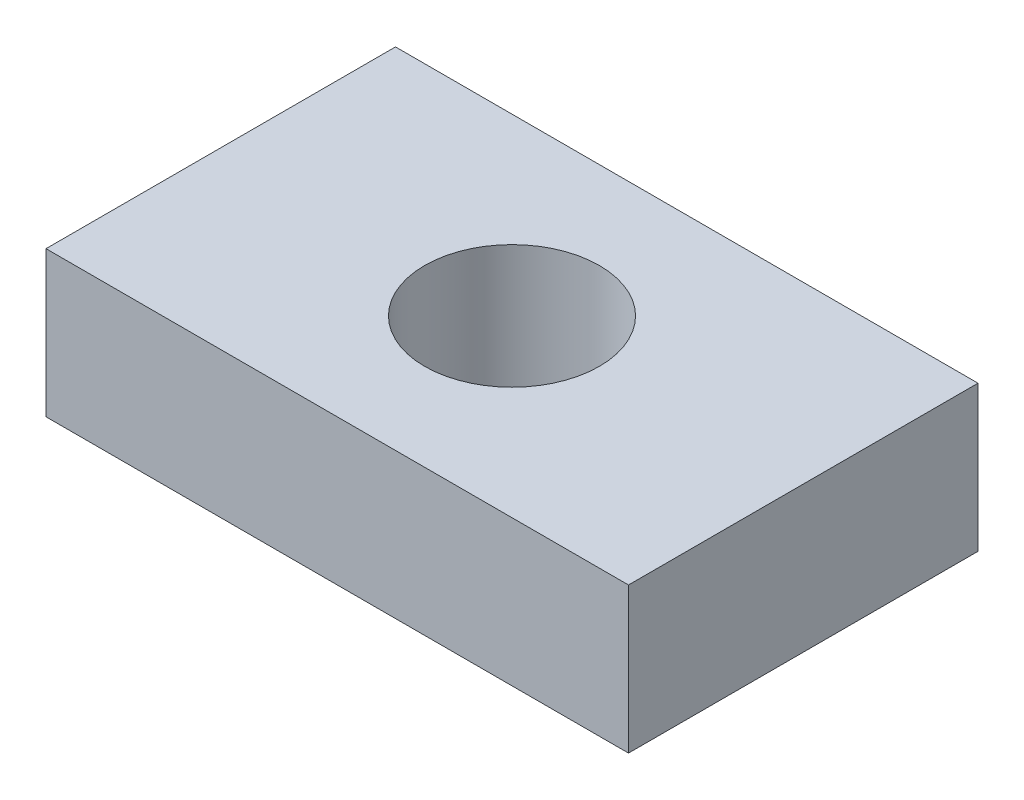
ISO-10303-21;
HEADER;
FILE_DESCRIPTION(('STEP AP214'),'2;1');
FILE_NAME('part.step','',(''),(''),'','','');
FILE_SCHEMA(('AUTOMOTIVE_DESIGN { 1 0 10303 214 1 1 1 1 }'));
ENDSEC;
DATA;
#1=APPLICATION_CONTEXT('core data for automotive mechanical design processes');
#2=APPLICATION_PROTOCOL_DEFINITION('international standard','automotive_design',2000,#1);
#3=PRODUCT_CONTEXT('',#1,'mechanical');
#4=PRODUCT('Part','Part','',(#3));
#5=PRODUCT_RELATED_PRODUCT_CATEGORY('part','',(#4));
#6=PRODUCT_DEFINITION_FORMATION('','',#4);
#7=PRODUCT_DEFINITION_CONTEXT('part definition',#1,'design');
#8=PRODUCT_DEFINITION('design','',#6,#7);
#9=PRODUCT_DEFINITION_SHAPE('','',#8);
#10=(LENGTH_UNIT() NAMED_UNIT(*) SI_UNIT(.MILLI.,.METRE.));
#11=(NAMED_UNIT(*) PLANE_ANGLE_UNIT() SI_UNIT($,.RADIAN.));
#12=(NAMED_UNIT(*) SI_UNIT($,.STERADIAN.) SOLID_ANGLE_UNIT());
#13=UNCERTAINTY_MEASURE_WITH_UNIT(LENGTH_MEASURE(1.E-05),#10,'distance_accuracy_value','');
#14=(GEOMETRIC_REPRESENTATION_CONTEXT(3) GLOBAL_UNCERTAINTY_ASSIGNED_CONTEXT((#13)) GLOBAL_UNIT_ASSIGNED_CONTEXT((#10,
#11,#12)) REPRESENTATION_CONTEXT('',''));
#15=CARTESIAN_POINT('',(0.,0.,0.));
#16=DIRECTION('',(0.,0.,1.));
#17=DIRECTION('',(1.,0.,0.));
#18=AXIS2_PLACEMENT_3D('',#15,#16,#17);
#19=CARTESIAN_POINT('',(0.,2.5,0.));
#20=DIRECTION('',(0.,-1.,0.));
#21=DIRECTION('',(0.,0.,-1.));
#22=AXIS2_PLACEMENT_3D('',#19,#20,#21);
#23=PLANE('',#22);
#24=DIRECTION('',(0.,0.,-1.));
#25=VECTOR('',#24,1.);
#26=CARTESIAN_POINT('',(5.,2.5,3.));
#27=LINE('',#26,#25);
#28=CARTESIAN_POINT('',(5.,2.5,3.));
#29=VERTEX_POINT('',#28);
#30=CARTESIAN_POINT('',(5.,2.5,-3.));
#31=VERTEX_POINT('',#30);
#32=EDGE_CURVE('E92',#29,#31,#27,.T.);
#33=ORIENTED_EDGE('',*,*,#32,.T.);
#34=DIRECTION('',(-1.,0.,0.));
#35=VECTOR('',#34,1.);
#36=CARTESIAN_POINT('',(-5.,2.5,-3.));
#37=LINE('',#36,#35);
#38=CARTESIAN_POINT('',(-5.,2.5,-3.));
#39=VERTEX_POINT('',#38);
#40=EDGE_CURVE('E87',#31,#39,#37,.T.);
#41=ORIENTED_EDGE('',*,*,#40,.T.);
#42=DIRECTION('',(0.,0.,1.));
#43=VECTOR('',#42,1.);
#44=CARTESIAN_POINT('',(-5.,2.5,3.));
#45=LINE('',#44,#43);
#46=CARTESIAN_POINT('',(-5.,2.5,3.));
#47=VERTEX_POINT('',#46);
#48=EDGE_CURVE('E90',#39,#47,#45,.T.);
#49=ORIENTED_EDGE('',*,*,#48,.T.);
#50=DIRECTION('',(1.,0.,0.));
#51=VECTOR('',#50,1.);
#52=CARTESIAN_POINT('',(-5.,2.5,3.));
#53=LINE('',#52,#51);
#54=EDGE_CURVE('E57',#47,#29,#53,.T.);
#55=ORIENTED_EDGE('',*,*,#54,.T.);
#56=EDGE_LOOP('',(#33,#41,#49,#55));
#57=FACE_BOUND('',#56,.T.);
#58=CARTESIAN_POINT('',(0.,2.5,0.));
#59=DIRECTION('',(0.,1.,0.));
#60=DIRECTION('',(0.,0.,1.));
#61=AXIS2_PLACEMENT_3D('',#58,#59,#60);
#62=CIRCLE('',#61,1.5);
#63=CARTESIAN_POINT('',(0.,2.5,1.5));
#64=VERTEX_POINT('',#63);
#65=EDGE_CURVE('E112',#64,#64,#62,.T.);
#66=ORIENTED_EDGE('',*,*,#65,.F.);
#67=EDGE_LOOP('',(#66));
#68=FACE_BOUND('',#67,.T.);
#69=ADVANCED_FACE('F39',(#57,#68),#23,.F.);
#70=CARTESIAN_POINT('',(0.,0.,0.));
#71=DIRECTION('',(0.,-1.,0.));
#72=DIRECTION('',(0.,0.,-1.));
#73=AXIS2_PLACEMENT_3D('',#70,#71,#72);
#74=PLANE('',#73);
#75=DIRECTION('',(0.,0.,-1.));
#76=VECTOR('',#75,1.);
#77=CARTESIAN_POINT('',(5.,0.,3.));
#78=LINE('',#77,#76);
#79=CARTESIAN_POINT('',(5.,0.,3.));
#80=VERTEX_POINT('',#79);
#81=CARTESIAN_POINT('',(5.,0.,-3.));
#82=VERTEX_POINT('',#81);
#83=EDGE_CURVE('E108',#80,#82,#78,.T.);
#84=ORIENTED_EDGE('',*,*,#83,.F.);
#85=DIRECTION('',(1.,0.,0.));
#86=VECTOR('',#85,1.);
#87=CARTESIAN_POINT('',(-5.,0.,3.));
#88=LINE('',#87,#86);
#89=CARTESIAN_POINT('',(-5.,0.,3.));
#90=VERTEX_POINT('',#89);
#91=EDGE_CURVE('E80',#90,#80,#88,.T.);
#92=ORIENTED_EDGE('',*,*,#91,.F.);
#93=DIRECTION('',(0.,0.,1.));
#94=VECTOR('',#93,1.);
#95=CARTESIAN_POINT('',(-5.,0.,3.));
#96=LINE('',#95,#94);
#97=CARTESIAN_POINT('',(-5.,0.,-3.));
#98=VERTEX_POINT('',#97);
#99=EDGE_CURVE('E74',#98,#90,#96,.T.);
#100=ORIENTED_EDGE('',*,*,#99,.F.);
#101=DIRECTION('',(-1.,0.,0.));
#102=VECTOR('',#101,1.);
#103=CARTESIAN_POINT('',(-5.,0.,-3.));
#104=LINE('',#103,#102);
#105=EDGE_CURVE('E97',#82,#98,#104,.T.);
#106=ORIENTED_EDGE('',*,*,#105,.F.);
#107=EDGE_LOOP('',(#84,#92,#100,#106));
#108=FACE_BOUND('',#107,.T.);
#109=CARTESIAN_POINT('',(0.,0.,0.));
#110=DIRECTION('',(0.,1.,0.));
#111=DIRECTION('',(0.,0.,1.));
#112=AXIS2_PLACEMENT_3D('',#109,#110,#111);
#113=CIRCLE('',#112,1.5);
#114=CARTESIAN_POINT('',(0.,0.,1.5));
#115=VERTEX_POINT('',#114);
#116=EDGE_CURVE('E130',#115,#115,#113,.T.);
#117=ORIENTED_EDGE('',*,*,#116,.T.);
#118=EDGE_LOOP('',(#117));
#119=FACE_BOUND('',#118,.T.);
#120=ADVANCED_FACE('F125',(#108,#119),#74,.T.);
#121=CARTESIAN_POINT('',(5.,2.5,3.));
#122=DIRECTION('',(-1.,0.,0.));
#123=DIRECTION('',(0.,0.,1.));
#124=AXIS2_PLACEMENT_3D('',#121,#122,#123);
#125=PLANE('',#124);
#126=ORIENTED_EDGE('',*,*,#83,.T.);
#127=DIRECTION('',(0.,-1.,0.));
#128=VECTOR('',#127,1.);
#129=CARTESIAN_POINT('',(5.,2.5,-3.));
#130=LINE('',#129,#128);
#131=EDGE_CURVE('E11',#31,#82,#130,.T.);
#132=ORIENTED_EDGE('',*,*,#131,.F.);
#133=ORIENTED_EDGE('',*,*,#32,.F.);
#134=DIRECTION('',(0.,-1.,0.));
#135=VECTOR('',#134,1.);
#136=CARTESIAN_POINT('',(5.,2.5,3.));
#137=LINE('',#136,#135);
#138=EDGE_CURVE('E104',#29,#80,#137,.T.);
#139=ORIENTED_EDGE('',*,*,#138,.T.);
#140=EDGE_LOOP('',(#126,#132,#133,#139));
#141=FACE_BOUND('',#140,.T.);
#142=ADVANCED_FACE('F41',(#141),#125,.F.);
#143=CARTESIAN_POINT('',(-5.,2.5,-3.));
#144=DIRECTION('',(0.,0.,1.));
#145=DIRECTION('',(1.,0.,0.));
#146=AXIS2_PLACEMENT_3D('',#143,#144,#145);
#147=PLANE('',#146);
#148=ORIENTED_EDGE('',*,*,#105,.T.);
#149=DIRECTION('',(0.,-1.,0.));
#150=VECTOR('',#149,1.);
#151=CARTESIAN_POINT('',(-5.,2.5,-3.));
#152=LINE('',#151,#150);
#153=EDGE_CURVE('E49',#39,#98,#152,.T.);
#154=ORIENTED_EDGE('',*,*,#153,.F.);
#155=ORIENTED_EDGE('',*,*,#40,.F.);
#156=ORIENTED_EDGE('',*,*,#131,.T.);
#157=EDGE_LOOP('',(#148,#154,#155,#156));
#158=FACE_BOUND('',#157,.T.);
#159=ADVANCED_FACE('F96',(#158),#147,.F.);
#160=CARTESIAN_POINT('',(-5.,2.5,3.));
#161=DIRECTION('',(1.,0.,0.));
#162=DIRECTION('',(0.,0.,-1.));
#163=AXIS2_PLACEMENT_3D('',#160,#161,#162);
#164=PLANE('',#163);
#165=ORIENTED_EDGE('',*,*,#99,.T.);
#166=DIRECTION('',(0.,-1.,0.));
#167=VECTOR('',#166,1.);
#168=CARTESIAN_POINT('',(-5.,2.5,3.));
#169=LINE('',#168,#167);
#170=EDGE_CURVE('E99',#47,#90,#169,.T.);
#171=ORIENTED_EDGE('',*,*,#170,.F.);
#172=ORIENTED_EDGE('',*,*,#48,.F.);
#173=ORIENTED_EDGE('',*,*,#153,.T.);
#174=EDGE_LOOP('',(#165,#171,#172,#173));
#175=FACE_BOUND('',#174,.T.);
#176=ADVANCED_FACE('F100',(#175),#164,.F.);
#177=CARTESIAN_POINT('',(-5.,2.5,3.));
#178=DIRECTION('',(0.,0.,-1.));
#179=DIRECTION('',(-1.,0.,0.));
#180=AXIS2_PLACEMENT_3D('',#177,#178,#179);
#181=PLANE('',#180);
#182=ORIENTED_EDGE('',*,*,#91,.T.);
#183=ORIENTED_EDGE('',*,*,#138,.F.);
#184=ORIENTED_EDGE('',*,*,#54,.F.);
#185=ORIENTED_EDGE('',*,*,#170,.T.);
#186=EDGE_LOOP('',(#182,#183,#184,#185));
#187=FACE_BOUND('',#186,.T.);
#188=ADVANCED_FACE('F122',(#187),#181,.F.);
#189=CARTESIAN_POINT('',(0.,2.5,0.));
#190=DIRECTION('',(0.,-1.,0.));
#191=DIRECTION('',(0.,0.,-1.));
#192=AXIS2_PLACEMENT_3D('',#189,#190,#191);
#193=CYLINDRICAL_SURFACE('',#192,1.5);
#194=ORIENTED_EDGE('',*,*,#65,.T.);
#195=EDGE_LOOP('',(#194));
#196=FACE_BOUND('',#195,.T.);
#197=ORIENTED_EDGE('',*,*,#116,.F.);
#198=EDGE_LOOP('',(#197));
#199=FACE_BOUND('',#198,.T.);
#200=ADVANCED_FACE('F138',(#196,#199),#193,.F.);
#201=CLOSED_SHELL('',(#69,#120,#142,#159,#176,#188,#200));
#202=MANIFOLD_SOLID_BREP('B2',#201);
#203=ADVANCED_BREP_SHAPE_REPRESENTATION('',(#18,#202),#14);
#204=SHAPE_DEFINITION_REPRESENTATION(#9,#203);
ENDSEC;
END-ISO-10303-21;
